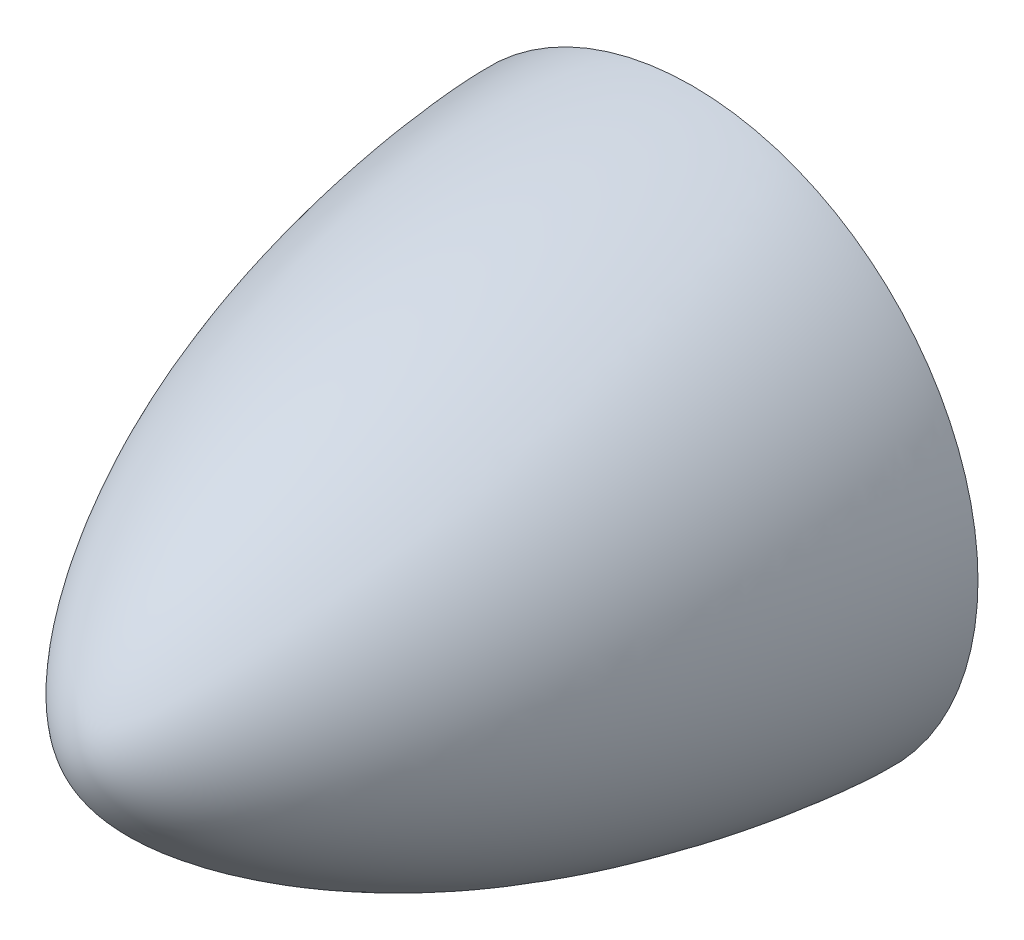
ISO-10303-21;
HEADER;
FILE_DESCRIPTION(('STEP AP214'),'2;1');
FILE_NAME('part.step','',(''),(''),'','','');
FILE_SCHEMA(('AUTOMOTIVE_DESIGN { 1 0 10303 214 1 1 1 1 }'));
ENDSEC;
DATA;
#1=APPLICATION_CONTEXT('core data for automotive mechanical design processes');
#2=APPLICATION_PROTOCOL_DEFINITION('international standard','automotive_design',2000,#1);
#3=PRODUCT_CONTEXT('',#1,'mechanical');
#4=PRODUCT('Part','Part','',(#3));
#5=PRODUCT_RELATED_PRODUCT_CATEGORY('part','',(#4));
#6=PRODUCT_DEFINITION_FORMATION('','',#4);
#7=PRODUCT_DEFINITION_CONTEXT('part definition',#1,'design');
#8=PRODUCT_DEFINITION('design','',#6,#7);
#9=PRODUCT_DEFINITION_SHAPE('','',#8);
#10=(LENGTH_UNIT() NAMED_UNIT(*) SI_UNIT(.MILLI.,.METRE.));
#11=(NAMED_UNIT(*) PLANE_ANGLE_UNIT() SI_UNIT($,.RADIAN.));
#12=(NAMED_UNIT(*) SI_UNIT($,.STERADIAN.) SOLID_ANGLE_UNIT());
#13=UNCERTAINTY_MEASURE_WITH_UNIT(LENGTH_MEASURE(1.E-05),#10,'distance_accuracy_value','');
#14=(GEOMETRIC_REPRESENTATION_CONTEXT(3) GLOBAL_UNCERTAINTY_ASSIGNED_CONTEXT((#13)) GLOBAL_UNIT_ASSIGNED_CONTEXT((#10,
#11,#12)) REPRESENTATION_CONTEXT('',''));
#15=CARTESIAN_POINT('',(0.,0.,0.));
#16=DIRECTION('',(0.,0.,1.));
#17=DIRECTION('',(1.,0.,0.));
#18=AXIS2_PLACEMENT_3D('',#15,#16,#17);
#19=CARTESIAN_POINT('',(0.,0.,0.));
#20=DIRECTION('',(0.,0.,1.));
#21=DIRECTION('',(1.,0.,0.));
#22=AXIS2_PLACEMENT_3D('',#19,#20,#21);
#23=PLANE('',#22);
#24=CARTESIAN_POINT('',(0.,0.,0.));
#25=DIRECTION('',(0.,0.,1.));
#26=DIRECTION('',(1.,0.,0.));
#27=AXIS2_PLACEMENT_3D('',#24,#25,#26);
#28=CIRCLE('',#27,37.4897480361321);
#29=CARTESIAN_POINT('',(37.4897480361321,0.,0.));
#30=VERTEX_POINT('',#29);
#31=EDGE_CURVE('E11',#30,#30,#28,.T.);
#32=ORIENTED_EDGE('',*,*,#31,.F.);
#33=EDGE_LOOP('',(#32));
#34=FACE_BOUND('',#33,.T.);
#35=ADVANCED_FACE('F47',(#34),#23,.F.);
#36=CARTESIAN_POINT('',(0.,37.4897480361321,0.));
#37=CARTESIAN_POINT('',(0.,37.4897480361321,6.52084695748737));
#38=CARTESIAN_POINT('',(0.,33.8883213341238,45.5781419121905));
#39=CARTESIAN_POINT('',(0.,8.79535371796593,80.0000000000001));
#40=CARTESIAN_POINT('',(0.,0.,80.));
#41=B_SPLINE_CURVE_WITH_KNOTS('',3,(#36,#37,#38,#39,#40),.UNSPECIFIED.,.F.,.F.,(4,1,4),(0.,
0.555466861198949,1.),.UNSPECIFIED.);
#42=CARTESIAN_POINT('',(0.,0.,80.));
#43=DIRECTION('',(0.,0.,1.));
#44=AXIS1_PLACEMENT('',#42,#43);
#45=SURFACE_OF_REVOLUTION('',#41,#44);
#46=CARTESIAN_POINT('',(0.,0.,80.));
#47=VERTEX_POINT('',#46);
#48=VERTEX_LOOP('',#47);
#49=FACE_BOUND('',#48,.T.);
#50=ORIENTED_EDGE('',*,*,#31,.T.);
#51=EDGE_LOOP('',(#50));
#52=FACE_BOUND('',#51,.T.);
#53=ADVANCED_FACE('F56',(#49,#52),#45,.T.);
#54=CLOSED_SHELL('',(#35,#53));
#55=MANIFOLD_SOLID_BREP('B2',#54);
#56=ADVANCED_BREP_SHAPE_REPRESENTATION('',(#18,#55),#14);
#57=SHAPE_DEFINITION_REPRESENTATION(#9,#56);
ENDSEC;
END-ISO-10303-21;
